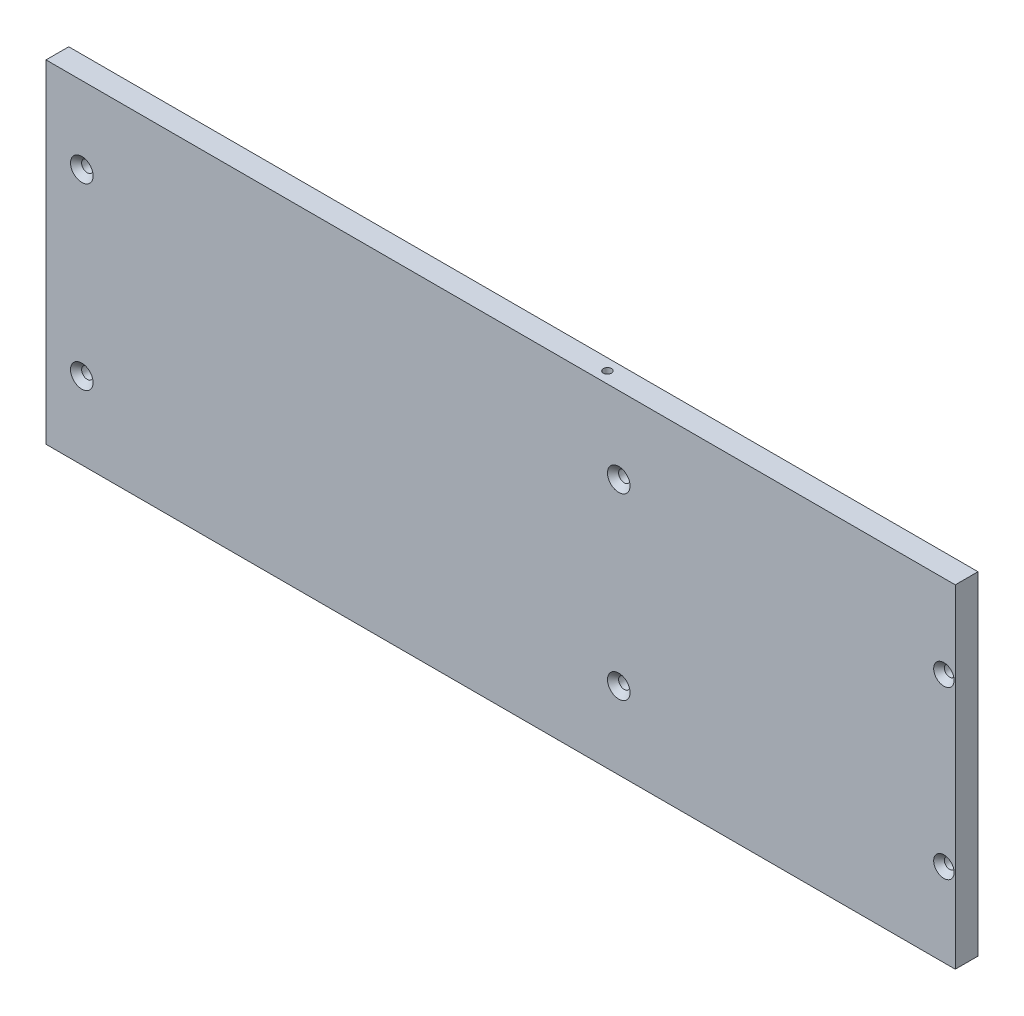
ISO-10303-21;
HEADER;
FILE_DESCRIPTION(('STEP AP214'),'2;1');
FILE_NAME('part.step','',(''),(''),'','','');
FILE_SCHEMA(('AUTOMOTIVE_DESIGN { 1 0 10303 214 1 1 1 1 }'));
ENDSEC;
DATA;
#1=APPLICATION_CONTEXT('core data for automotive mechanical design processes');
#2=APPLICATION_PROTOCOL_DEFINITION('international standard','automotive_design',2000,#1);
#3=PRODUCT_CONTEXT('',#1,'mechanical');
#4=PRODUCT('Part','Part','',(#3));
#5=PRODUCT_RELATED_PRODUCT_CATEGORY('part','',(#4));
#6=PRODUCT_DEFINITION_FORMATION('','',#4);
#7=PRODUCT_DEFINITION_CONTEXT('part definition',#1,'design');
#8=PRODUCT_DEFINITION('design','',#6,#7);
#9=PRODUCT_DEFINITION_SHAPE('','',#8);
#10=(LENGTH_UNIT() NAMED_UNIT(*) SI_UNIT(.MILLI.,.METRE.));
#11=(NAMED_UNIT(*) PLANE_ANGLE_UNIT() SI_UNIT($,.RADIAN.));
#12=(NAMED_UNIT(*) SI_UNIT($,.STERADIAN.) SOLID_ANGLE_UNIT());
#13=UNCERTAINTY_MEASURE_WITH_UNIT(LENGTH_MEASURE(1.E-05),#10,'distance_accuracy_value','');
#14=(GEOMETRIC_REPRESENTATION_CONTEXT(3) GLOBAL_UNCERTAINTY_ASSIGNED_CONTEXT((#13)) GLOBAL_UNIT_ASSIGNED_CONTEXT((#10,
#11,#12)) REPRESENTATION_CONTEXT('',''));
#15=CARTESIAN_POINT('',(0.,0.,0.));
#16=DIRECTION('',(0.,0.,1.));
#17=DIRECTION('',(1.,0.,0.));
#18=AXIS2_PLACEMENT_3D('',#15,#16,#17);
#19=CARTESIAN_POINT('',(127.,46.5,6.35));
#20=DIRECTION('',(-1.,0.,0.));
#21=DIRECTION('',(0.,-1.,0.));
#22=AXIS2_PLACEMENT_3D('',#19,#20,#21);
#23=PLANE('',#22);
#24=DIRECTION('',(0.,1.,0.));
#25=VECTOR('',#24,1.);
#26=CARTESIAN_POINT('',(127.,46.5,0.));
#27=LINE('',#26,#25);
#28=CARTESIAN_POINT('',(127.,-46.5,0.));
#29=VERTEX_POINT('',#28);
#30=CARTESIAN_POINT('',(127.,46.5,0.));
#31=VERTEX_POINT('',#30);
#32=EDGE_CURVE('E169',#29,#31,#27,.T.);
#33=ORIENTED_EDGE('',*,*,#32,.T.);
#34=DIRECTION('',(0.,0.,-1.));
#35=VECTOR('',#34,1.);
#36=CARTESIAN_POINT('',(127.,46.5,6.35));
#37=LINE('',#36,#35);
#38=CARTESIAN_POINT('',(127.,46.5,6.35));
#39=VERTEX_POINT('',#38);
#40=EDGE_CURVE('E11',#39,#31,#37,.T.);
#41=ORIENTED_EDGE('',*,*,#40,.F.);
#42=DIRECTION('',(0.,1.,0.));
#43=VECTOR('',#42,1.);
#44=CARTESIAN_POINT('',(127.,46.5,6.35));
#45=LINE('',#44,#43);
#46=CARTESIAN_POINT('',(127.,-46.5,6.35));
#47=VERTEX_POINT('',#46);
#48=EDGE_CURVE('E170',#47,#39,#45,.T.);
#49=ORIENTED_EDGE('',*,*,#48,.F.);
#50=DIRECTION('',(0.,0.,-1.));
#51=VECTOR('',#50,1.);
#52=CARTESIAN_POINT('',(127.,-46.5,6.35));
#53=LINE('',#52,#51);
#54=EDGE_CURVE('E176',#47,#29,#53,.T.);
#55=ORIENTED_EDGE('',*,*,#54,.T.);
#56=EDGE_LOOP('',(#33,#41,#49,#55));
#57=FACE_BOUND('',#56,.T.);
#58=ADVANCED_FACE('F49',(#57),#23,.F.);
#59=CARTESIAN_POINT('',(-127.,46.5,6.35));
#60=DIRECTION('',(0.,-1.,0.));
#61=DIRECTION('',(1.,0.,0.));
#62=AXIS2_PLACEMENT_3D('',#59,#60,#61);
#63=PLANE('',#62);
#64=CARTESIAN_POINT('',(26.65,46.5,3.175));
#65=DIRECTION('',(0.,1.,0.));
#66=DIRECTION('',(0.,0.,1.));
#67=AXIS2_PLACEMENT_3D('',#64,#65,#66);
#68=CIRCLE('',#67,1.13029999999999);
#69=CARTESIAN_POINT('',(26.65,46.5,4.30529999999999));
#70=VERTEX_POINT('',#69);
#71=EDGE_CURVE('E111',#70,#70,#68,.T.);
#72=ORIENTED_EDGE('',*,*,#71,.F.);
#73=EDGE_LOOP('',(#72));
#74=FACE_BOUND('',#73,.T.);
#75=DIRECTION('',(-1.,0.,0.));
#76=VECTOR('',#75,1.);
#77=CARTESIAN_POINT('',(-127.,46.5,0.));
#78=LINE('',#77,#76);
#79=CARTESIAN_POINT('',(-127.,46.5,0.));
#80=VERTEX_POINT('',#79);
#81=EDGE_CURVE('E179',#31,#80,#78,.T.);
#82=ORIENTED_EDGE('',*,*,#81,.T.);
#83=DIRECTION('',(0.,0.,-1.));
#84=VECTOR('',#83,1.);
#85=CARTESIAN_POINT('',(-127.,46.5,6.35));
#86=LINE('',#85,#84);
#87=CARTESIAN_POINT('',(-127.,46.5,6.35));
#88=VERTEX_POINT('',#87);
#89=EDGE_CURVE('E57',#88,#80,#86,.T.);
#90=ORIENTED_EDGE('',*,*,#89,.F.);
#91=DIRECTION('',(-1.,0.,0.));
#92=VECTOR('',#91,1.);
#93=CARTESIAN_POINT('',(-127.,46.5,6.35));
#94=LINE('',#93,#92);
#95=EDGE_CURVE('E96',#39,#88,#94,.T.);
#96=ORIENTED_EDGE('',*,*,#95,.F.);
#97=ORIENTED_EDGE('',*,*,#40,.T.);
#98=EDGE_LOOP('',(#82,#90,#96,#97));
#99=FACE_BOUND('',#98,.T.);
#100=ADVANCED_FACE('F204',(#74,#99),#63,.F.);
#101=CARTESIAN_POINT('',(-127.,46.5,6.35));
#102=DIRECTION('',(1.,0.,0.));
#103=DIRECTION('',(0.,1.,0.));
#104=AXIS2_PLACEMENT_3D('',#101,#102,#103);
#105=PLANE('',#104);
#106=DIRECTION('',(0.,-1.,0.));
#107=VECTOR('',#106,1.);
#108=CARTESIAN_POINT('',(-127.,46.5,0.));
#109=LINE('',#108,#107);
#110=CARTESIAN_POINT('',(-127.,-46.5,0.));
#111=VERTEX_POINT('',#110);
#112=EDGE_CURVE('E83',#80,#111,#109,.T.);
#113=ORIENTED_EDGE('',*,*,#112,.T.);
#114=DIRECTION('',(0.,0.,-1.));
#115=VECTOR('',#114,1.);
#116=CARTESIAN_POINT('',(-127.,-46.5,6.35));
#117=LINE('',#116,#115);
#118=CARTESIAN_POINT('',(-127.,-46.5,6.35));
#119=VERTEX_POINT('',#118);
#120=EDGE_CURVE('E184',#119,#111,#117,.T.);
#121=ORIENTED_EDGE('',*,*,#120,.F.);
#122=DIRECTION('',(0.,-1.,0.));
#123=VECTOR('',#122,1.);
#124=CARTESIAN_POINT('',(-127.,46.5,6.35));
#125=LINE('',#124,#123);
#126=EDGE_CURVE('E173',#88,#119,#125,.T.);
#127=ORIENTED_EDGE('',*,*,#126,.F.);
#128=ORIENTED_EDGE('',*,*,#89,.T.);
#129=EDGE_LOOP('',(#113,#121,#127,#128));
#130=FACE_BOUND('',#129,.T.);
#131=ADVANCED_FACE('F186',(#130),#105,.F.);
#132=CARTESIAN_POINT('',(-127.,-46.5,6.35));
#133=DIRECTION('',(0.,1.,0.));
#134=DIRECTION('',(0.,0.,1.));
#135=AXIS2_PLACEMENT_3D('',#132,#133,#134);
#136=PLANE('',#135);
#137=DIRECTION('',(1.,0.,0.));
#138=VECTOR('',#137,1.);
#139=CARTESIAN_POINT('',(-127.,-46.5,0.));
#140=LINE('',#139,#138);
#141=EDGE_CURVE('E89',#111,#29,#140,.T.);
#142=ORIENTED_EDGE('',*,*,#141,.T.);
#143=ORIENTED_EDGE('',*,*,#54,.F.);
#144=DIRECTION('',(1.,0.,0.));
#145=VECTOR('',#144,1.);
#146=CARTESIAN_POINT('',(-127.,-46.5,6.35));
#147=LINE('',#146,#145);
#148=EDGE_CURVE('E65',#119,#47,#147,.T.);
#149=ORIENTED_EDGE('',*,*,#148,.F.);
#150=ORIENTED_EDGE('',*,*,#120,.T.);
#151=EDGE_LOOP('',(#142,#143,#149,#150));
#152=FACE_BOUND('',#151,.T.);
#153=ADVANCED_FACE('F193',(#152),#136,.F.);
#154=CARTESIAN_POINT('',(0.,0.,6.35));
#155=DIRECTION('',(0.,0.,1.));
#156=DIRECTION('',(1.,0.,0.));
#157=AXIS2_PLACEMENT_3D('',#154,#155,#156);
#158=PLANE('',#157);
#159=CARTESIAN_POINT('',(-117.,25.,6.35));
#160=DIRECTION('',(0.,0.,1.));
#161=DIRECTION('',(1.,0.,0.));
#162=AXIS2_PLACEMENT_3D('',#159,#160,#161);
#163=CIRCLE('',#162,3.15);
#164=CARTESIAN_POINT('',(-113.85,25.,6.35));
#165=VERTEX_POINT('',#164);
#166=EDGE_CURVE('E110',#165,#165,#163,.T.);
#167=ORIENTED_EDGE('',*,*,#166,.F.);
#168=EDGE_LOOP('',(#167));
#169=FACE_BOUND('',#168,.T.);
#170=CARTESIAN_POINT('',(-117.,-25.,6.35));
#171=DIRECTION('',(0.,0.,1.));
#172=DIRECTION('',(1.,0.,0.));
#173=AXIS2_PLACEMENT_3D('',#170,#171,#172);
#174=CIRCLE('',#173,3.15);
#175=CARTESIAN_POINT('',(-113.85,-25.,6.35));
#176=VERTEX_POINT('',#175);
#177=EDGE_CURVE('E124',#176,#176,#174,.T.);
#178=ORIENTED_EDGE('',*,*,#177,.F.);
#179=EDGE_LOOP('',(#178));
#180=FACE_BOUND('',#179,.T.);
#181=CARTESIAN_POINT('',(33.,-25.,6.35));
#182=DIRECTION('',(0.,0.,1.));
#183=DIRECTION('',(1.,0.,0.));
#184=AXIS2_PLACEMENT_3D('',#181,#182,#183);
#185=CIRCLE('',#184,3.15);
#186=CARTESIAN_POINT('',(36.15,-25.,6.35));
#187=VERTEX_POINT('',#186);
#188=EDGE_CURVE('E133',#187,#187,#185,.T.);
#189=ORIENTED_EDGE('',*,*,#188,.F.);
#190=EDGE_LOOP('',(#189));
#191=FACE_BOUND('',#190,.T.);
#192=CARTESIAN_POINT('',(33.,25.,6.35));
#193=DIRECTION('',(0.,0.,1.));
#194=DIRECTION('',(1.,0.,0.));
#195=AXIS2_PLACEMENT_3D('',#192,#193,#194);
#196=CIRCLE('',#195,3.15);
#197=CARTESIAN_POINT('',(36.15,25.,6.35));
#198=VERTEX_POINT('',#197);
#199=EDGE_CURVE('E142',#198,#198,#196,.T.);
#200=ORIENTED_EDGE('',*,*,#199,.F.);
#201=EDGE_LOOP('',(#200));
#202=FACE_BOUND('',#201,.T.);
#203=CARTESIAN_POINT('',(123.824999999999,23.2499999460016,6.35));
#204=DIRECTION('',(0.,0.,1.));
#205=DIRECTION('',(1.,0.,0.));
#206=AXIS2_PLACEMENT_3D('',#203,#204,#205);
#207=CIRCLE('',#206,2.8575);
#208=CARTESIAN_POINT('',(126.682499999999,23.2499999460016,6.35));
#209=VERTEX_POINT('',#208);
#210=EDGE_CURVE('E151',#209,#209,#207,.T.);
#211=ORIENTED_EDGE('',*,*,#210,.F.);
#212=EDGE_LOOP('',(#211));
#213=FACE_BOUND('',#212,.T.);
#214=CARTESIAN_POINT('',(123.824999999999,-23.2500000179984,6.35));
#215=DIRECTION('',(0.,0.,1.));
#216=DIRECTION('',(1.,0.,0.));
#217=AXIS2_PLACEMENT_3D('',#214,#215,#216);
#218=CIRCLE('',#217,2.8575);
#219=CARTESIAN_POINT('',(126.682499999999,-23.2500000179984,6.35));
#220=VERTEX_POINT('',#219);
#221=EDGE_CURVE('E160',#220,#220,#218,.T.);
#222=ORIENTED_EDGE('',*,*,#221,.F.);
#223=EDGE_LOOP('',(#222));
#224=FACE_BOUND('',#223,.T.);
#225=ORIENTED_EDGE('',*,*,#48,.T.);
#226=ORIENTED_EDGE('',*,*,#95,.T.);
#227=ORIENTED_EDGE('',*,*,#126,.T.);
#228=ORIENTED_EDGE('',*,*,#148,.T.);
#229=EDGE_LOOP('',(#225,#226,#227,#228));
#230=FACE_BOUND('',#229,.T.);
#231=ADVANCED_FACE('F195',(#169,#180,#191,#202,#213,#224,#230),#158,.T.);
#232=CARTESIAN_POINT('',(0.,0.,0.));
#233=DIRECTION('',(0.,0.,1.));
#234=DIRECTION('',(1.,0.,0.));
#235=AXIS2_PLACEMENT_3D('',#232,#233,#234);
#236=PLANE('',#235);
#237=CARTESIAN_POINT('',(-117.,25.,0.));
#238=DIRECTION('',(0.,0.,1.));
#239=DIRECTION('',(1.,0.,0.));
#240=AXIS2_PLACEMENT_3D('',#237,#238,#239);
#241=CIRCLE('',#240,1.6);
#242=CARTESIAN_POINT('',(-115.4,25.,0.));
#243=VERTEX_POINT('',#242);
#244=EDGE_CURVE('E121',#243,#243,#241,.T.);
#245=ORIENTED_EDGE('',*,*,#244,.T.);
#246=EDGE_LOOP('',(#245));
#247=FACE_BOUND('',#246,.T.);
#248=CARTESIAN_POINT('',(-117.,-25.,0.));
#249=DIRECTION('',(0.,0.,1.));
#250=DIRECTION('',(1.,0.,0.));
#251=AXIS2_PLACEMENT_3D('',#248,#249,#250);
#252=CIRCLE('',#251,1.6);
#253=CARTESIAN_POINT('',(-115.4,-25.,0.));
#254=VERTEX_POINT('',#253);
#255=EDGE_CURVE('E130',#254,#254,#252,.T.);
#256=ORIENTED_EDGE('',*,*,#255,.T.);
#257=EDGE_LOOP('',(#256));
#258=FACE_BOUND('',#257,.T.);
#259=CARTESIAN_POINT('',(33.,-25.,0.));
#260=DIRECTION('',(0.,0.,1.));
#261=DIRECTION('',(1.,0.,0.));
#262=AXIS2_PLACEMENT_3D('',#259,#260,#261);
#263=CIRCLE('',#262,1.6);
#264=CARTESIAN_POINT('',(34.6,-25.,0.));
#265=VERTEX_POINT('',#264);
#266=EDGE_CURVE('E139',#265,#265,#263,.T.);
#267=ORIENTED_EDGE('',*,*,#266,.T.);
#268=EDGE_LOOP('',(#267));
#269=FACE_BOUND('',#268,.T.);
#270=CARTESIAN_POINT('',(33.,25.,0.));
#271=DIRECTION('',(0.,0.,1.));
#272=DIRECTION('',(1.,0.,0.));
#273=AXIS2_PLACEMENT_3D('',#270,#271,#272);
#274=CIRCLE('',#273,1.6);
#275=CARTESIAN_POINT('',(34.6,25.,0.));
#276=VERTEX_POINT('',#275);
#277=EDGE_CURVE('E148',#276,#276,#274,.T.);
#278=ORIENTED_EDGE('',*,*,#277,.T.);
#279=EDGE_LOOP('',(#278));
#280=FACE_BOUND('',#279,.T.);
#281=CARTESIAN_POINT('',(123.824999999999,23.2499999460016,0.));
#282=DIRECTION('',(0.,0.,1.));
#283=DIRECTION('',(1.,0.,0.));
#284=AXIS2_PLACEMENT_3D('',#281,#282,#283);
#285=CIRCLE('',#284,1.47319999999999);
#286=CARTESIAN_POINT('',(125.298199999999,23.2499999460016,0.));
#287=VERTEX_POINT('',#286);
#288=EDGE_CURVE('E157',#287,#287,#285,.T.);
#289=ORIENTED_EDGE('',*,*,#288,.T.);
#290=EDGE_LOOP('',(#289));
#291=FACE_BOUND('',#290,.T.);
#292=CARTESIAN_POINT('',(123.824999999999,-23.2500000179984,0.));
#293=DIRECTION('',(0.,0.,1.));
#294=DIRECTION('',(1.,0.,0.));
#295=AXIS2_PLACEMENT_3D('',#292,#293,#294);
#296=CIRCLE('',#295,1.47319999999999);
#297=CARTESIAN_POINT('',(125.298199999999,-23.2500000179984,0.));
#298=VERTEX_POINT('',#297);
#299=EDGE_CURVE('E166',#298,#298,#296,.T.);
#300=ORIENTED_EDGE('',*,*,#299,.T.);
#301=EDGE_LOOP('',(#300));
#302=FACE_BOUND('',#301,.T.);
#303=ORIENTED_EDGE('',*,*,#32,.F.);
#304=ORIENTED_EDGE('',*,*,#141,.F.);
#305=ORIENTED_EDGE('',*,*,#112,.F.);
#306=ORIENTED_EDGE('',*,*,#81,.F.);
#307=EDGE_LOOP('',(#303,#304,#305,#306));
#308=FACE_BOUND('',#307,.T.);
#309=ADVANCED_FACE('F189',(#247,#258,#269,#280,#291,#302,#308),#236,.F.);
#310=CARTESIAN_POINT('',(123.824999999999,-23.2500000179984,6.35));
#311=DIRECTION('',(0.,0.,1.));
#312=DIRECTION('',(1.,0.,0.));
#313=AXIS2_PLACEMENT_3D('',#310,#311,#312);
#314=CYLINDRICAL_SURFACE('',#313,1.47319999999999);
#315=ORIENTED_EDGE('',*,*,#299,.F.);
#316=EDGE_LOOP('',(#315));
#317=FACE_BOUND('',#316,.T.);
#318=CARTESIAN_POINT('',(123.824999999999,-23.2500000179984,4.75754501388396));
#319=DIRECTION('',(0.,0.,1.));
#320=DIRECTION('',(1.,0.,0.));
#321=AXIS2_PLACEMENT_3D('',#318,#319,#320);
#322=CIRCLE('',#321,1.47319999999999);
#323=CARTESIAN_POINT('',(125.298199999999,-23.2500000179984,4.75754501388396));
#324=VERTEX_POINT('',#323);
#325=EDGE_CURVE('E163',#324,#324,#322,.T.);
#326=ORIENTED_EDGE('',*,*,#325,.T.);
#327=EDGE_LOOP('',(#326));
#328=FACE_BOUND('',#327,.T.);
#329=ADVANCED_FACE('F263',(#317,#328),#314,.F.);
#330=CARTESIAN_POINT('',(123.824999999999,-23.2500000179984,6.35));
#331=DIRECTION('',(0.,0.,1.));
#332=DIRECTION('',(1.,0.,0.));
#333=AXIS2_PLACEMENT_3D('',#330,#331,#332);
#334=CONICAL_SURFACE('',#333,2.8575,0.715584993317677);
#335=ORIENTED_EDGE('',*,*,#325,.F.);
#336=EDGE_LOOP('',(#335));
#337=FACE_BOUND('',#336,.T.);
#338=ORIENTED_EDGE('',*,*,#221,.T.);
#339=EDGE_LOOP('',(#338));
#340=FACE_BOUND('',#339,.T.);
#341=ADVANCED_FACE('F259',(#337,#340),#334,.F.);
#342=CARTESIAN_POINT('',(123.824999999999,23.2499999460016,6.35));
#343=DIRECTION('',(0.,0.,1.));
#344=DIRECTION('',(1.,0.,0.));
#345=AXIS2_PLACEMENT_3D('',#342,#343,#344);
#346=CYLINDRICAL_SURFACE('',#345,1.47319999999999);
#347=ORIENTED_EDGE('',*,*,#288,.F.);
#348=EDGE_LOOP('',(#347));
#349=FACE_BOUND('',#348,.T.);
#350=CARTESIAN_POINT('',(123.824999999999,23.2499999460016,4.75754501388396));
#351=DIRECTION('',(0.,0.,1.));
#352=DIRECTION('',(1.,0.,0.));
#353=AXIS2_PLACEMENT_3D('',#350,#351,#352);
#354=CIRCLE('',#353,1.47319999999999);
#355=CARTESIAN_POINT('',(125.298199999999,23.2499999460016,4.75754501388396));
#356=VERTEX_POINT('',#355);
#357=EDGE_CURVE('E154',#356,#356,#354,.T.);
#358=ORIENTED_EDGE('',*,*,#357,.T.);
#359=EDGE_LOOP('',(#358));
#360=FACE_BOUND('',#359,.T.);
#361=ADVANCED_FACE('F255',(#349,#360),#346,.F.);
#362=CARTESIAN_POINT('',(123.824999999999,23.2499999460016,6.35));
#363=DIRECTION('',(0.,0.,1.));
#364=DIRECTION('',(1.,0.,0.));
#365=AXIS2_PLACEMENT_3D('',#362,#363,#364);
#366=CONICAL_SURFACE('',#365,2.8575,0.715584993317677);
#367=ORIENTED_EDGE('',*,*,#357,.F.);
#368=EDGE_LOOP('',(#367));
#369=FACE_BOUND('',#368,.T.);
#370=ORIENTED_EDGE('',*,*,#210,.T.);
#371=EDGE_LOOP('',(#370));
#372=FACE_BOUND('',#371,.T.);
#373=ADVANCED_FACE('F251',(#369,#372),#366,.F.);
#374=CARTESIAN_POINT('',(33.,25.,6.35));
#375=DIRECTION('',(0.,0.,1.));
#376=DIRECTION('',(1.,0.,0.));
#377=AXIS2_PLACEMENT_3D('',#374,#375,#376);
#378=CYLINDRICAL_SURFACE('',#377,1.6);
#379=ORIENTED_EDGE('',*,*,#277,.F.);
#380=EDGE_LOOP('',(#379));
#381=FACE_BOUND('',#380,.T.);
#382=CARTESIAN_POINT('',(33.,25.,4.8));
#383=DIRECTION('',(0.,0.,1.));
#384=DIRECTION('',(1.,0.,0.));
#385=AXIS2_PLACEMENT_3D('',#382,#383,#384);
#386=CIRCLE('',#385,1.6);
#387=CARTESIAN_POINT('',(34.6,25.,4.8));
#388=VERTEX_POINT('',#387);
#389=EDGE_CURVE('E145',#388,#388,#386,.T.);
#390=ORIENTED_EDGE('',*,*,#389,.T.);
#391=EDGE_LOOP('',(#390));
#392=FACE_BOUND('',#391,.T.);
#393=ADVANCED_FACE('F247',(#381,#392),#378,.F.);
#394=CARTESIAN_POINT('',(33.,25.,6.35));
#395=DIRECTION('',(0.,0.,1.));
#396=DIRECTION('',(1.,0.,0.));
#397=AXIS2_PLACEMENT_3D('',#394,#395,#396);
#398=CONICAL_SURFACE('',#397,3.15,0.785398163397448);
#399=ORIENTED_EDGE('',*,*,#389,.F.);
#400=EDGE_LOOP('',(#399));
#401=FACE_BOUND('',#400,.T.);
#402=ORIENTED_EDGE('',*,*,#199,.T.);
#403=EDGE_LOOP('',(#402));
#404=FACE_BOUND('',#403,.T.);
#405=ADVANCED_FACE('F243',(#401,#404),#398,.F.);
#406=CARTESIAN_POINT('',(33.,-25.,6.35));
#407=DIRECTION('',(0.,0.,1.));
#408=DIRECTION('',(1.,0.,0.));
#409=AXIS2_PLACEMENT_3D('',#406,#407,#408);
#410=CYLINDRICAL_SURFACE('',#409,1.6);
#411=ORIENTED_EDGE('',*,*,#266,.F.);
#412=EDGE_LOOP('',(#411));
#413=FACE_BOUND('',#412,.T.);
#414=CARTESIAN_POINT('',(33.,-25.,4.8));
#415=DIRECTION('',(0.,0.,1.));
#416=DIRECTION('',(1.,0.,0.));
#417=AXIS2_PLACEMENT_3D('',#414,#415,#416);
#418=CIRCLE('',#417,1.6);
#419=CARTESIAN_POINT('',(34.6,-25.,4.8));
#420=VERTEX_POINT('',#419);
#421=EDGE_CURVE('E136',#420,#420,#418,.T.);
#422=ORIENTED_EDGE('',*,*,#421,.T.);
#423=EDGE_LOOP('',(#422));
#424=FACE_BOUND('',#423,.T.);
#425=ADVANCED_FACE('F239',(#413,#424),#410,.F.);
#426=CARTESIAN_POINT('',(33.,-25.,6.35));
#427=DIRECTION('',(0.,0.,1.));
#428=DIRECTION('',(1.,0.,0.));
#429=AXIS2_PLACEMENT_3D('',#426,#427,#428);
#430=CONICAL_SURFACE('',#429,3.15,0.785398163397448);
#431=ORIENTED_EDGE('',*,*,#421,.F.);
#432=EDGE_LOOP('',(#431));
#433=FACE_BOUND('',#432,.T.);
#434=ORIENTED_EDGE('',*,*,#188,.T.);
#435=EDGE_LOOP('',(#434));
#436=FACE_BOUND('',#435,.T.);
#437=ADVANCED_FACE('F235',(#433,#436),#430,.F.);
#438=CARTESIAN_POINT('',(-117.,-25.,6.35));
#439=DIRECTION('',(0.,0.,1.));
#440=DIRECTION('',(1.,0.,0.));
#441=AXIS2_PLACEMENT_3D('',#438,#439,#440);
#442=CYLINDRICAL_SURFACE('',#441,1.6);
#443=ORIENTED_EDGE('',*,*,#255,.F.);
#444=EDGE_LOOP('',(#443));
#445=FACE_BOUND('',#444,.T.);
#446=CARTESIAN_POINT('',(-117.,-25.,4.8));
#447=DIRECTION('',(0.,0.,1.));
#448=DIRECTION('',(1.,0.,0.));
#449=AXIS2_PLACEMENT_3D('',#446,#447,#448);
#450=CIRCLE('',#449,1.6);
#451=CARTESIAN_POINT('',(-115.4,-25.,4.8));
#452=VERTEX_POINT('',#451);
#453=EDGE_CURVE('E127',#452,#452,#450,.T.);
#454=ORIENTED_EDGE('',*,*,#453,.T.);
#455=EDGE_LOOP('',(#454));
#456=FACE_BOUND('',#455,.T.);
#457=ADVANCED_FACE('F231',(#445,#456),#442,.F.);
#458=CARTESIAN_POINT('',(-117.,-25.,6.35));
#459=DIRECTION('',(0.,0.,1.));
#460=DIRECTION('',(1.,0.,0.));
#461=AXIS2_PLACEMENT_3D('',#458,#459,#460);
#462=CONICAL_SURFACE('',#461,3.15,0.785398163397446);
#463=ORIENTED_EDGE('',*,*,#453,.F.);
#464=EDGE_LOOP('',(#463));
#465=FACE_BOUND('',#464,.T.);
#466=ORIENTED_EDGE('',*,*,#177,.T.);
#467=EDGE_LOOP('',(#466));
#468=FACE_BOUND('',#467,.T.);
#469=ADVANCED_FACE('F227',(#465,#468),#462,.F.);
#470=CARTESIAN_POINT('',(-117.,25.,6.35));
#471=DIRECTION('',(0.,0.,1.));
#472=DIRECTION('',(1.,0.,0.));
#473=AXIS2_PLACEMENT_3D('',#470,#471,#472);
#474=CYLINDRICAL_SURFACE('',#473,1.6);
#475=ORIENTED_EDGE('',*,*,#244,.F.);
#476=EDGE_LOOP('',(#475));
#477=FACE_BOUND('',#476,.T.);
#478=CARTESIAN_POINT('',(-117.,25.,4.8));
#479=DIRECTION('',(0.,0.,1.));
#480=DIRECTION('',(1.,0.,0.));
#481=AXIS2_PLACEMENT_3D('',#478,#479,#480);
#482=CIRCLE('',#481,1.6);
#483=CARTESIAN_POINT('',(-115.4,25.,4.8));
#484=VERTEX_POINT('',#483);
#485=EDGE_CURVE('E114',#484,#484,#482,.T.);
#486=ORIENTED_EDGE('',*,*,#485,.T.);
#487=EDGE_LOOP('',(#486));
#488=FACE_BOUND('',#487,.T.);
#489=ADVANCED_FACE('F223',(#477,#488),#474,.F.);
#490=CARTESIAN_POINT('',(-117.,25.,6.35));
#491=DIRECTION('',(0.,0.,1.));
#492=DIRECTION('',(1.,0.,0.));
#493=AXIS2_PLACEMENT_3D('',#490,#491,#492);
#494=CONICAL_SURFACE('',#493,3.15,0.785398163397446);
#495=ORIENTED_EDGE('',*,*,#485,.F.);
#496=EDGE_LOOP('',(#495));
#497=FACE_BOUND('',#496,.T.);
#498=ORIENTED_EDGE('',*,*,#166,.T.);
#499=EDGE_LOOP('',(#498));
#500=FACE_BOUND('',#499,.T.);
#501=ADVANCED_FACE('F104',(#497,#500),#494,.F.);
#502=CARTESIAN_POINT('',(26.65,38.245,3.175));
#503=DIRECTION('',(0.,1.,0.));
#504=DIRECTION('',(0.,0.,1.));
#505=AXIS2_PLACEMENT_3D('',#502,#503,#504);
#506=CONICAL_SURFACE('',#505,1.1303,1.02974425867665);
#507=CARTESIAN_POINT('',(26.65,37.5658472423131,3.175));
#508=VERTEX_POINT('',#507);
#509=VERTEX_LOOP('',#508);
#510=FACE_BOUND('',#509,.T.);
#511=CARTESIAN_POINT('',(26.65,38.245,3.175));
#512=DIRECTION('',(0.,1.,0.));
#513=DIRECTION('',(0.,0.,1.));
#514=AXIS2_PLACEMENT_3D('',#511,#512,#513);
#515=CIRCLE('',#514,1.1303);
#516=CARTESIAN_POINT('',(26.65,38.245,4.3053));
#517=VERTEX_POINT('',#516);
#518=EDGE_CURVE('E108',#517,#517,#515,.T.);
#519=ORIENTED_EDGE('',*,*,#518,.T.);
#520=EDGE_LOOP('',(#519));
#521=FACE_BOUND('',#520,.T.);
#522=ADVANCED_FACE('F100',(#510,#521),#506,.F.);
#523=CARTESIAN_POINT('',(26.65,46.5,3.175));
#524=DIRECTION('',(0.,1.,0.));
#525=DIRECTION('',(0.,0.,1.));
#526=AXIS2_PLACEMENT_3D('',#523,#524,#525);
#527=CYLINDRICAL_SURFACE('',#526,1.13029999999999);
#528=ORIENTED_EDGE('',*,*,#518,.F.);
#529=EDGE_LOOP('',(#528));
#530=FACE_BOUND('',#529,.T.);
#531=ORIENTED_EDGE('',*,*,#71,.T.);
#532=EDGE_LOOP('',(#531));
#533=FACE_BOUND('',#532,.T.);
#534=ADVANCED_FACE('F103',(#530,#533),#527,.F.);
#535=CLOSED_SHELL('',(#58,#100,#131,#153,#231,#309,#329,#341,#361,#373,#393,#405,#425,#437,#457,
#469,#489,#501,#522,#534));
#536=MANIFOLD_SOLID_BREP('B2',#535);
#537=ADVANCED_BREP_SHAPE_REPRESENTATION('',(#18,#536),#14);
#538=SHAPE_DEFINITION_REPRESENTATION(#9,#537);
ENDSEC;
END-ISO-10303-21;
